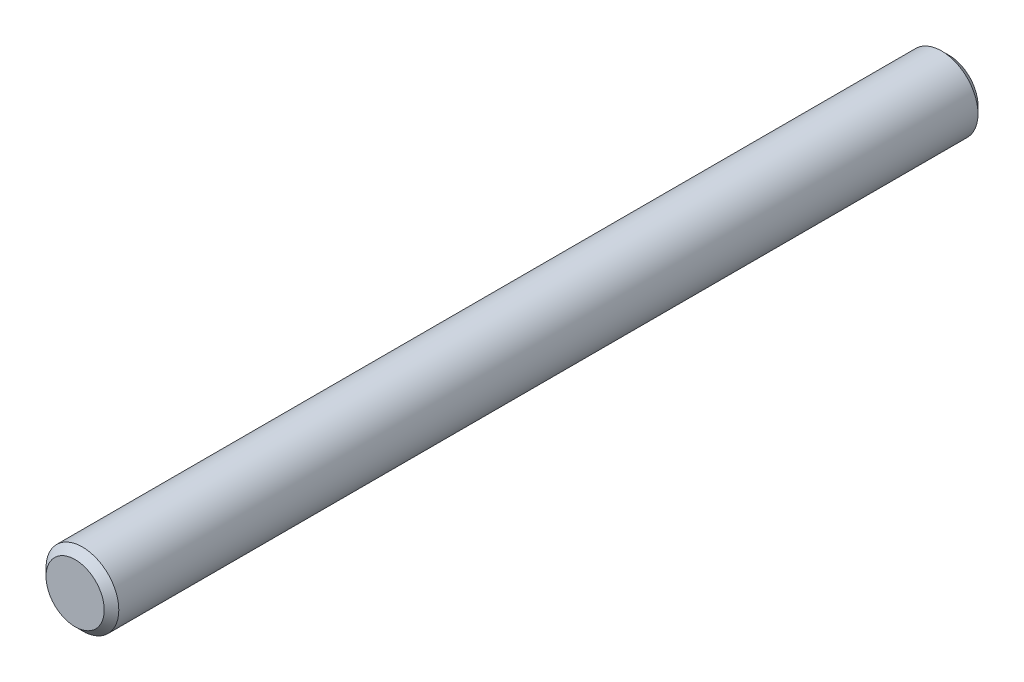
ISO-10303-21;
HEADER;
FILE_DESCRIPTION(('STEP AP214'),'2;1');
FILE_NAME('part.step','',(''),(''),'','','');
FILE_SCHEMA(('AUTOMOTIVE_DESIGN { 1 0 10303 214 1 1 1 1 }'));
ENDSEC;
DATA;
#1=APPLICATION_CONTEXT('core data for automotive mechanical design processes');
#2=APPLICATION_PROTOCOL_DEFINITION('international standard','automotive_design',2000,#1);
#3=PRODUCT_CONTEXT('',#1,'mechanical');
#4=PRODUCT('Part','Part','',(#3));
#5=PRODUCT_RELATED_PRODUCT_CATEGORY('part','',(#4));
#6=PRODUCT_DEFINITION_FORMATION('','',#4);
#7=PRODUCT_DEFINITION_CONTEXT('part definition',#1,'design');
#8=PRODUCT_DEFINITION('design','',#6,#7);
#9=PRODUCT_DEFINITION_SHAPE('','',#8);
#10=(LENGTH_UNIT() NAMED_UNIT(*) SI_UNIT(.MILLI.,.METRE.));
#11=(NAMED_UNIT(*) PLANE_ANGLE_UNIT() SI_UNIT($,.RADIAN.));
#12=(NAMED_UNIT(*) SI_UNIT($,.STERADIAN.) SOLID_ANGLE_UNIT());
#13=UNCERTAINTY_MEASURE_WITH_UNIT(LENGTH_MEASURE(1.E-05),#10,'distance_accuracy_value','');
#14=(GEOMETRIC_REPRESENTATION_CONTEXT(3) GLOBAL_UNCERTAINTY_ASSIGNED_CONTEXT((#13)) GLOBAL_UNIT_ASSIGNED_CONTEXT((#10,
#11,#12)) REPRESENTATION_CONTEXT('',''));
#15=CARTESIAN_POINT('',(0.,0.,0.));
#16=DIRECTION('',(0.,0.,1.));
#17=DIRECTION('',(1.,0.,0.));
#18=AXIS2_PLACEMENT_3D('',#15,#16,#17);
#19=CARTESIAN_POINT('',(0.,0.,38.1));
#20=DIRECTION('',(0.,0.,-1.));
#21=DIRECTION('',(-1.,0.,0.));
#22=AXIS2_PLACEMENT_3D('',#19,#20,#21);
#23=CYLINDRICAL_SURFACE('',#22,3.175);
#24=CARTESIAN_POINT('',(0.,0.,-37.4649999999999));
#25=DIRECTION('',(0.,0.,1.));
#26=DIRECTION('',(1.,0.,0.));
#27=AXIS2_PLACEMENT_3D('',#24,#25,#26);
#28=CIRCLE('',#27,3.175);
#29=CARTESIAN_POINT('',(3.175,0.,-37.4649999999999));
#30=VERTEX_POINT('',#29);
#31=EDGE_CURVE('E48',#30,#30,#28,.T.);
#32=ORIENTED_EDGE('',*,*,#31,.T.);
#33=EDGE_LOOP('',(#32));
#34=FACE_BOUND('',#33,.T.);
#35=CARTESIAN_POINT('',(0.,0.,37.465));
#36=DIRECTION('',(0.,0.,1.));
#37=DIRECTION('',(1.,0.,0.));
#38=AXIS2_PLACEMENT_3D('',#35,#36,#37);
#39=CIRCLE('',#38,3.175);
#40=CARTESIAN_POINT('',(3.175,0.,37.465));
#41=VERTEX_POINT('',#40);
#42=EDGE_CURVE('E52',#41,#41,#39,.F.);
#43=ORIENTED_EDGE('',*,*,#42,.T.);
#44=EDGE_LOOP('',(#43));
#45=FACE_BOUND('',#44,.T.);
#46=ADVANCED_FACE('F37',(#34,#45),#23,.T.);
#47=CARTESIAN_POINT('',(0.,0.,38.1));
#48=DIRECTION('',(0.,0.,1.));
#49=DIRECTION('',(1.,0.,0.));
#50=AXIS2_PLACEMENT_3D('',#47,#48,#49);
#51=PLANE('',#50);
#52=CARTESIAN_POINT('',(0.,0.,38.1));
#53=DIRECTION('',(0.,0.,1.));
#54=DIRECTION('',(1.,0.,0.));
#55=AXIS2_PLACEMENT_3D('',#52,#53,#54);
#56=CIRCLE('',#55,2.54000000000002);
#57=CARTESIAN_POINT('',(2.54000000000002,0.,38.1));
#58=VERTEX_POINT('',#57);
#59=EDGE_CURVE('E10',#58,#58,#56,.T.);
#60=ORIENTED_EDGE('',*,*,#59,.T.);
#61=EDGE_LOOP('',(#60));
#62=FACE_BOUND('',#61,.T.);
#63=ADVANCED_FACE('F68',(#62),#51,.T.);
#64=CARTESIAN_POINT('',(0.,0.,-38.1));
#65=DIRECTION('',(0.,0.,1.));
#66=DIRECTION('',(1.,0.,0.));
#67=AXIS2_PLACEMENT_3D('',#64,#65,#66);
#68=PLANE('',#67);
#69=CARTESIAN_POINT('',(0.,0.,-38.1));
#70=DIRECTION('',(0.,0.,1.));
#71=DIRECTION('',(1.,0.,0.));
#72=AXIS2_PLACEMENT_3D('',#69,#70,#71);
#73=CIRCLE('',#72,2.53999999999994);
#74=CARTESIAN_POINT('',(2.53999999999994,0.,-38.1));
#75=VERTEX_POINT('',#74);
#76=EDGE_CURVE('E44',#75,#75,#73,.F.);
#77=ORIENTED_EDGE('',*,*,#76,.T.);
#78=EDGE_LOOP('',(#77));
#79=FACE_BOUND('',#78,.T.);
#80=ADVANCED_FACE('F65',(#79),#68,.F.);
#81=CARTESIAN_POINT('',(0.,0.,-37.4649999999999));
#82=DIRECTION('',(0.,0.,1.));
#83=DIRECTION('',(1.,0.,0.));
#84=AXIS2_PLACEMENT_3D('',#81,#82,#83);
#85=CONICAL_SURFACE('',#84,3.175,0.785398163397445);
#86=ORIENTED_EDGE('',*,*,#76,.F.);
#87=EDGE_LOOP('',(#86));
#88=FACE_BOUND('',#87,.T.);
#89=ORIENTED_EDGE('',*,*,#31,.F.);
#90=EDGE_LOOP('',(#89));
#91=FACE_BOUND('',#90,.T.);
#92=ADVANCED_FACE('F61',(#88,#91),#85,.T.);
#93=CARTESIAN_POINT('',(0.,0.,38.1));
#94=DIRECTION('',(0.,0.,-1.));
#95=DIRECTION('',(-1.,0.,0.));
#96=AXIS2_PLACEMENT_3D('',#93,#94,#95);
#97=CONICAL_SURFACE('',#96,2.54000000000002,0.785398163397445);
#98=ORIENTED_EDGE('',*,*,#42,.F.);
#99=EDGE_LOOP('',(#98));
#100=FACE_BOUND('',#99,.T.);
#101=ORIENTED_EDGE('',*,*,#59,.F.);
#102=EDGE_LOOP('',(#101));
#103=FACE_BOUND('',#102,.T.);
#104=ADVANCED_FACE('F39',(#100,#103),#97,.T.);
#105=CLOSED_SHELL('',(#46,#63,#80,#92,#104));
#106=MANIFOLD_SOLID_BREP('B2',#105);
#107=ADVANCED_BREP_SHAPE_REPRESENTATION('',(#18,#106),#14);
#108=SHAPE_DEFINITION_REPRESENTATION(#9,#107);
ENDSEC;
END-ISO-10303-21;
